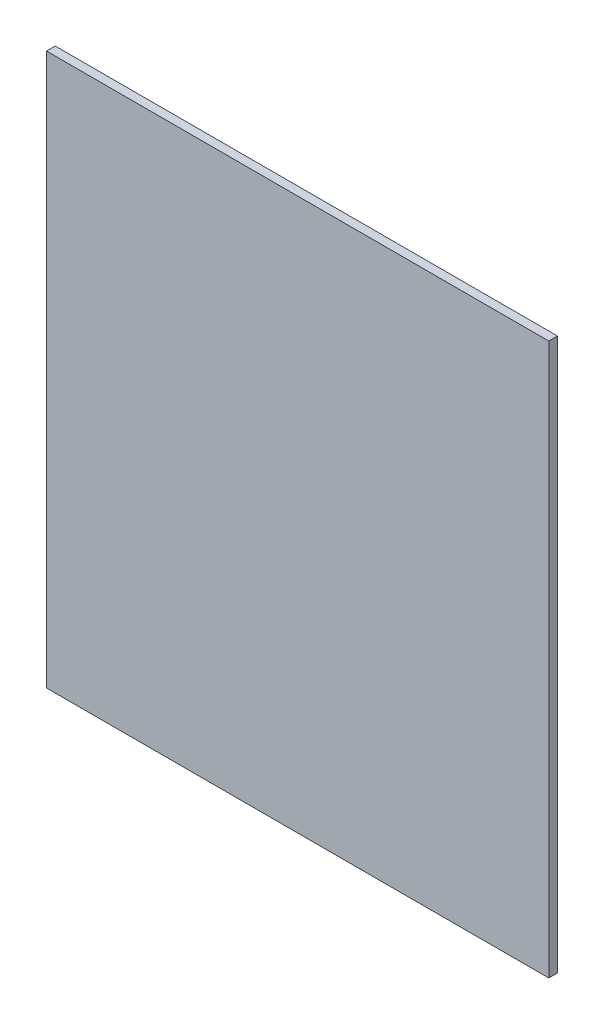
ISO-10303-21;
HEADER;
FILE_DESCRIPTION(('STEP AP214'),'2;1');
FILE_NAME('part.step','',(''),(''),'','','');
FILE_SCHEMA(('AUTOMOTIVE_DESIGN { 1 0 10303 214 1 1 1 1 }'));
ENDSEC;
DATA;
#1=APPLICATION_CONTEXT('core data for automotive mechanical design processes');
#2=APPLICATION_PROTOCOL_DEFINITION('international standard','automotive_design',2000,#1);
#3=PRODUCT_CONTEXT('',#1,'mechanical');
#4=PRODUCT('Part','Part','',(#3));
#5=PRODUCT_RELATED_PRODUCT_CATEGORY('part','',(#4));
#6=PRODUCT_DEFINITION_FORMATION('','',#4);
#7=PRODUCT_DEFINITION_CONTEXT('part definition',#1,'design');
#8=PRODUCT_DEFINITION('design','',#6,#7);
#9=PRODUCT_DEFINITION_SHAPE('','',#8);
#10=(LENGTH_UNIT() NAMED_UNIT(*) SI_UNIT(.MILLI.,.METRE.));
#11=(NAMED_UNIT(*) PLANE_ANGLE_UNIT() SI_UNIT($,.RADIAN.));
#12=(NAMED_UNIT(*) SI_UNIT($,.STERADIAN.) SOLID_ANGLE_UNIT());
#13=UNCERTAINTY_MEASURE_WITH_UNIT(LENGTH_MEASURE(1.E-05),#10,'distance_accuracy_value','');
#14=(GEOMETRIC_REPRESENTATION_CONTEXT(3) GLOBAL_UNCERTAINTY_ASSIGNED_CONTEXT((#13)) GLOBAL_UNIT_ASSIGNED_CONTEXT((#10,
#11,#12)) REPRESENTATION_CONTEXT('',''));
#15=CARTESIAN_POINT('',(0.,0.,0.));
#16=DIRECTION('',(0.,0.,1.));
#17=DIRECTION('',(1.,0.,0.));
#18=AXIS2_PLACEMENT_3D('',#15,#16,#17);
#19=CARTESIAN_POINT('',(435.839330178547,35.5513219666413,3.));
#20=DIRECTION('',(-1.,0.,0.));
#21=DIRECTION('',(0.,0.,1.));
#22=AXIS2_PLACEMENT_3D('',#19,#20,#21);
#23=PLANE('',#22);
#24=DIRECTION('',(0.,1.,0.));
#25=VECTOR('',#24,1.);
#26=CARTESIAN_POINT('',(435.839330178547,35.5513219666413,0.));
#27=LINE('',#26,#25);
#28=CARTESIAN_POINT('',(435.839330178547,-154.448678033359,0.));
#29=VERTEX_POINT('',#28);
#30=CARTESIAN_POINT('',(435.839330178547,35.5513219666413,0.));
#31=VERTEX_POINT('',#30);
#32=EDGE_CURVE('E96',#29,#31,#27,.T.);
#33=ORIENTED_EDGE('',*,*,#32,.T.);
#34=DIRECTION('',(0.,0.,-1.));
#35=VECTOR('',#34,1.);
#36=CARTESIAN_POINT('',(435.839330178547,35.5513219666413,3.));
#37=LINE('',#36,#35);
#38=CARTESIAN_POINT('',(435.839330178547,35.5513219666413,3.));
#39=VERTEX_POINT('',#38);
#40=EDGE_CURVE('E11',#39,#31,#37,.T.);
#41=ORIENTED_EDGE('',*,*,#40,.F.);
#42=DIRECTION('',(0.,1.,0.));
#43=VECTOR('',#42,1.);
#44=CARTESIAN_POINT('',(435.839330178547,35.5513219666413,3.));
#45=LINE('',#44,#43);
#46=CARTESIAN_POINT('',(435.839330178547,-154.448678033359,3.));
#47=VERTEX_POINT('',#46);
#48=EDGE_CURVE('E84',#47,#39,#45,.T.);
#49=ORIENTED_EDGE('',*,*,#48,.F.);
#50=DIRECTION('',(0.,0.,-1.));
#51=VECTOR('',#50,1.);
#52=CARTESIAN_POINT('',(435.839330178547,-154.448678033359,3.));
#53=LINE('',#52,#51);
#54=EDGE_CURVE('E92',#47,#29,#53,.T.);
#55=ORIENTED_EDGE('',*,*,#54,.T.);
#56=EDGE_LOOP('',(#33,#41,#49,#55));
#57=FACE_BOUND('',#56,.T.);
#58=ADVANCED_FACE('F33',(#57),#23,.F.);
#59=CARTESIAN_POINT('',(262.839330178547,35.5513219666413,3.));
#60=DIRECTION('',(0.,-1.,0.));
#61=DIRECTION('',(0.,0.,-1.));
#62=AXIS2_PLACEMENT_3D('',#59,#60,#61);
#63=PLANE('',#62);
#64=DIRECTION('',(-1.,0.,0.));
#65=VECTOR('',#64,1.);
#66=CARTESIAN_POINT('',(262.839330178547,35.5513219666413,0.));
#67=LINE('',#66,#65);
#68=CARTESIAN_POINT('',(262.839330178547,35.5513219666413,0.));
#69=VERTEX_POINT('',#68);
#70=EDGE_CURVE('E88',#31,#69,#67,.T.);
#71=ORIENTED_EDGE('',*,*,#70,.T.);
#72=DIRECTION('',(0.,0.,-1.));
#73=VECTOR('',#72,1.);
#74=CARTESIAN_POINT('',(262.839330178547,35.5513219666413,3.));
#75=LINE('',#74,#73);
#76=CARTESIAN_POINT('',(262.839330178547,35.5513219666413,3.));
#77=VERTEX_POINT('',#76);
#78=EDGE_CURVE('E41',#77,#69,#75,.T.);
#79=ORIENTED_EDGE('',*,*,#78,.F.);
#80=DIRECTION('',(-1.,0.,0.));
#81=VECTOR('',#80,1.);
#82=CARTESIAN_POINT('',(262.839330178547,35.5513219666413,3.));
#83=LINE('',#82,#81);
#84=EDGE_CURVE('E79',#39,#77,#83,.T.);
#85=ORIENTED_EDGE('',*,*,#84,.F.);
#86=ORIENTED_EDGE('',*,*,#40,.T.);
#87=EDGE_LOOP('',(#71,#79,#85,#86));
#88=FACE_BOUND('',#87,.T.);
#89=ADVANCED_FACE('F87',(#88),#63,.F.);
#90=CARTESIAN_POINT('',(262.839330178547,35.5513219666413,3.));
#91=DIRECTION('',(1.,0.,0.));
#92=DIRECTION('',(0.,0.,-1.));
#93=AXIS2_PLACEMENT_3D('',#90,#91,#92);
#94=PLANE('',#93);
#95=DIRECTION('',(0.,-1.,0.));
#96=VECTOR('',#95,1.);
#97=CARTESIAN_POINT('',(262.839330178547,35.5513219666413,0.));
#98=LINE('',#97,#96);
#99=CARTESIAN_POINT('',(262.839330178547,-154.448678033359,0.));
#100=VERTEX_POINT('',#99);
#101=EDGE_CURVE('E66',#69,#100,#98,.T.);
#102=ORIENTED_EDGE('',*,*,#101,.T.);
#103=DIRECTION('',(0.,0.,-1.));
#104=VECTOR('',#103,1.);
#105=CARTESIAN_POINT('',(262.839330178547,-154.448678033359,3.));
#106=LINE('',#105,#104);
#107=CARTESIAN_POINT('',(262.839330178547,-154.448678033359,3.));
#108=VERTEX_POINT('',#107);
#109=EDGE_CURVE('E89',#108,#100,#106,.T.);
#110=ORIENTED_EDGE('',*,*,#109,.F.);
#111=DIRECTION('',(0.,-1.,0.));
#112=VECTOR('',#111,1.);
#113=CARTESIAN_POINT('',(262.839330178547,35.5513219666413,3.));
#114=LINE('',#113,#112);
#115=EDGE_CURVE('E82',#77,#108,#114,.T.);
#116=ORIENTED_EDGE('',*,*,#115,.F.);
#117=ORIENTED_EDGE('',*,*,#78,.T.);
#118=EDGE_LOOP('',(#102,#110,#116,#117));
#119=FACE_BOUND('',#118,.T.);
#120=ADVANCED_FACE('F90',(#119),#94,.F.);
#121=CARTESIAN_POINT('',(262.839330178547,-154.448678033359,3.));
#122=DIRECTION('',(0.,1.,0.));
#123=DIRECTION('',(0.,0.,1.));
#124=AXIS2_PLACEMENT_3D('',#121,#122,#123);
#125=PLANE('',#124);
#126=DIRECTION('',(1.,0.,0.));
#127=VECTOR('',#126,1.);
#128=CARTESIAN_POINT('',(262.839330178547,-154.448678033359,0.));
#129=LINE('',#128,#127);
#130=EDGE_CURVE('E72',#100,#29,#129,.T.);
#131=ORIENTED_EDGE('',*,*,#130,.T.);
#132=ORIENTED_EDGE('',*,*,#54,.F.);
#133=DIRECTION('',(1.,0.,0.));
#134=VECTOR('',#133,1.);
#135=CARTESIAN_POINT('',(262.839330178547,-154.448678033359,3.));
#136=LINE('',#135,#134);
#137=EDGE_CURVE('E49',#108,#47,#136,.T.);
#138=ORIENTED_EDGE('',*,*,#137,.F.);
#139=ORIENTED_EDGE('',*,*,#109,.T.);
#140=EDGE_LOOP('',(#131,#132,#138,#139));
#141=FACE_BOUND('',#140,.T.);
#142=ADVANCED_FACE('F103',(#141),#125,.F.);
#143=CARTESIAN_POINT('',(0.,0.,3.));
#144=DIRECTION('',(0.,0.,1.));
#145=DIRECTION('',(1.,0.,0.));
#146=AXIS2_PLACEMENT_3D('',#143,#144,#145);
#147=PLANE('',#146);
#148=ORIENTED_EDGE('',*,*,#48,.T.);
#149=ORIENTED_EDGE('',*,*,#84,.T.);
#150=ORIENTED_EDGE('',*,*,#115,.T.);
#151=ORIENTED_EDGE('',*,*,#137,.T.);
#152=EDGE_LOOP('',(#148,#149,#150,#151));
#153=FACE_BOUND('',#152,.T.);
#154=ADVANCED_FACE('F80',(#153),#147,.T.);
#155=CARTESIAN_POINT('',(0.,0.,0.));
#156=DIRECTION('',(0.,0.,1.));
#157=DIRECTION('',(1.,0.,0.));
#158=AXIS2_PLACEMENT_3D('',#155,#156,#157);
#159=PLANE('',#158);
#160=ORIENTED_EDGE('',*,*,#32,.F.);
#161=ORIENTED_EDGE('',*,*,#130,.F.);
#162=ORIENTED_EDGE('',*,*,#101,.F.);
#163=ORIENTED_EDGE('',*,*,#70,.F.);
#164=EDGE_LOOP('',(#160,#161,#162,#163));
#165=FACE_BOUND('',#164,.T.);
#166=ADVANCED_FACE('F106',(#165),#159,.F.);
#167=CLOSED_SHELL('',(#58,#89,#120,#142,#154,#166));
#168=MANIFOLD_SOLID_BREP('B2',#167);
#169=ADVANCED_BREP_SHAPE_REPRESENTATION('',(#18,#168),#14);
#170=SHAPE_DEFINITION_REPRESENTATION(#9,#169);
ENDSEC;
END-ISO-10303-21;
